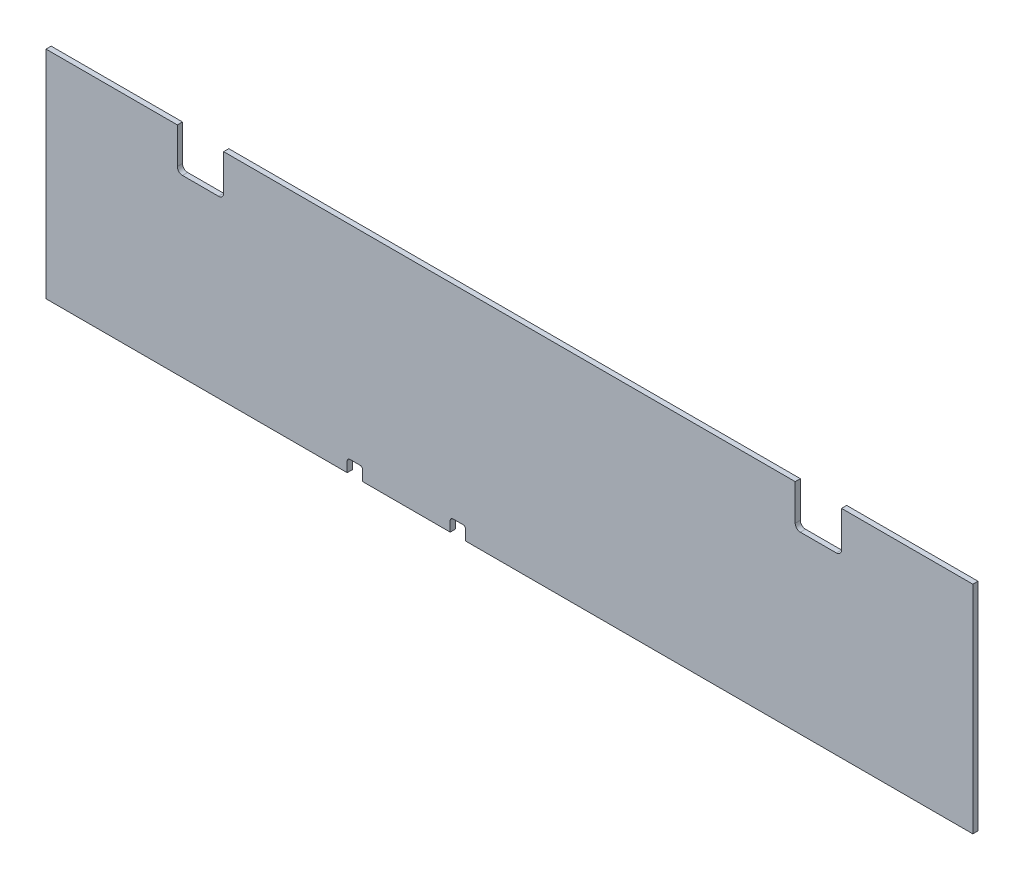
ISO-10303-21;
HEADER;
FILE_DESCRIPTION(('STEP AP214'),'2;1');
FILE_NAME('part.step','',(''),(''),'','','');
FILE_SCHEMA(('AUTOMOTIVE_DESIGN { 1 0 10303 214 1 1 1 1 }'));
ENDSEC;
DATA;
#1=APPLICATION_CONTEXT('core data for automotive mechanical design processes');
#2=APPLICATION_PROTOCOL_DEFINITION('international standard','automotive_design',2000,#1);
#3=PRODUCT_CONTEXT('',#1,'mechanical');
#4=PRODUCT('Part','Part','',(#3));
#5=PRODUCT_RELATED_PRODUCT_CATEGORY('part','',(#4));
#6=PRODUCT_DEFINITION_FORMATION('','',#4);
#7=PRODUCT_DEFINITION_CONTEXT('part definition',#1,'design');
#8=PRODUCT_DEFINITION('design','',#6,#7);
#9=PRODUCT_DEFINITION_SHAPE('','',#8);
#10=(LENGTH_UNIT() NAMED_UNIT(*) SI_UNIT(.MILLI.,.METRE.));
#11=(NAMED_UNIT(*) PLANE_ANGLE_UNIT() SI_UNIT($,.RADIAN.));
#12=(NAMED_UNIT(*) SI_UNIT($,.STERADIAN.) SOLID_ANGLE_UNIT());
#13=UNCERTAINTY_MEASURE_WITH_UNIT(LENGTH_MEASURE(1.E-05),#10,'distance_accuracy_value','');
#14=(GEOMETRIC_REPRESENTATION_CONTEXT(3) GLOBAL_UNCERTAINTY_ASSIGNED_CONTEXT((#13)) GLOBAL_UNIT_ASSIGNED_CONTEXT((#10,
#11,#12)) REPRESENTATION_CONTEXT('',''));
#15=CARTESIAN_POINT('',(0.,0.,0.));
#16=DIRECTION('',(0.,0.,1.));
#17=DIRECTION('',(1.,0.,0.));
#18=AXIS2_PLACEMENT_3D('',#15,#16,#17);
#19=CARTESIAN_POINT('',(1143.,0.,6.35));
#20=DIRECTION('',(0.,1.,0.));
#21=DIRECTION('',(-1.,0.,0.));
#22=AXIS2_PLACEMENT_3D('',#19,#20,#21);
#23=PLANE('',#22);
#24=DIRECTION('',(1.,0.,0.));
#25=VECTOR('',#24,1.);
#26=CARTESIAN_POINT('',(1143.,0.,0.));
#27=LINE('',#26,#25);
#28=CARTESIAN_POINT('',(0.,0.,0.));
#29=VERTEX_POINT('',#28);
#30=CARTESIAN_POINT('',(371.475,0.,0.));
#31=VERTEX_POINT('',#30);
#32=EDGE_CURVE('E222',#29,#31,#27,.T.);
#33=ORIENTED_EDGE('',*,*,#32,.T.);
#34=DIRECTION('',(0.,0.,1.));
#35=VECTOR('',#34,1.);
#36=CARTESIAN_POINT('',(371.475,0.,0.));
#37=LINE('',#36,#35);
#38=CARTESIAN_POINT('',(371.475,0.,6.35));
#39=VERTEX_POINT('',#38);
#40=EDGE_CURVE('E228',#31,#39,#37,.T.);
#41=ORIENTED_EDGE('',*,*,#40,.T.);
#42=DIRECTION('',(1.,0.,0.));
#43=VECTOR('',#42,1.);
#44=CARTESIAN_POINT('',(1143.,0.,6.35));
#45=LINE('',#44,#43);
#46=CARTESIAN_POINT('',(0.,0.,6.35));
#47=VERTEX_POINT('',#46);
#48=EDGE_CURVE('E283',#47,#39,#45,.T.);
#49=ORIENTED_EDGE('',*,*,#48,.F.);
#50=DIRECTION('',(0.,0.,-1.));
#51=VECTOR('',#50,1.);
#52=CARTESIAN_POINT('',(0.,0.,6.35));
#53=LINE('',#52,#51);
#54=EDGE_CURVE('E240',#47,#29,#53,.T.);
#55=ORIENTED_EDGE('',*,*,#54,.T.);
#56=EDGE_LOOP('',(#33,#41,#49,#55));
#57=FACE_BOUND('',#56,.T.);
#58=ADVANCED_FACE('F35',(#57),#23,.F.);
#59=CARTESIAN_POINT('',(390.525,0.,6.35));
#60=VERTEX_POINT('',#59);
#61=CARTESIAN_POINT('',(498.475,0.,6.35));
#62=VERTEX_POINT('',#61);
#63=EDGE_CURVE('E286',#60,#62,#45,.T.);
#64=ORIENTED_EDGE('',*,*,#63,.F.);
#65=DIRECTION('',(0.,0.,1.));
#66=VECTOR('',#65,1.);
#67=CARTESIAN_POINT('',(390.525,0.,0.));
#68=LINE('',#67,#66);
#69=CARTESIAN_POINT('',(390.525,0.,0.));
#70=VERTEX_POINT('',#69);
#71=EDGE_CURVE('E235',#70,#60,#68,.T.);
#72=ORIENTED_EDGE('',*,*,#71,.F.);
#73=CARTESIAN_POINT('',(498.475,0.,0.));
#74=VERTEX_POINT('',#73);
#75=EDGE_CURVE('E242',#70,#74,#27,.T.);
#76=ORIENTED_EDGE('',*,*,#75,.T.);
#77=DIRECTION('',(0.,0.,1.));
#78=VECTOR('',#77,1.);
#79=CARTESIAN_POINT('',(498.475,0.,0.));
#80=LINE('',#79,#78);
#81=EDGE_CURVE('E271',#74,#62,#80,.T.);
#82=ORIENTED_EDGE('',*,*,#81,.T.);
#83=EDGE_LOOP('',(#64,#72,#76,#82));
#84=FACE_BOUND('',#83,.T.);
#85=ADVANCED_FACE('F421',(#84),#23,.F.);
#86=CARTESIAN_POINT('',(517.525,0.,6.35));
#87=VERTEX_POINT('',#86);
#88=CARTESIAN_POINT('',(1143.,0.,6.35));
#89=VERTEX_POINT('',#88);
#90=EDGE_CURVE('E287',#87,#89,#45,.T.);
#91=ORIENTED_EDGE('',*,*,#90,.F.);
#92=DIRECTION('',(0.,0.,1.));
#93=VECTOR('',#92,1.);
#94=CARTESIAN_POINT('',(517.525,0.,0.));
#95=LINE('',#94,#93);
#96=CARTESIAN_POINT('',(517.525,0.,0.));
#97=VERTEX_POINT('',#96);
#98=EDGE_CURVE('E279',#97,#87,#95,.T.);
#99=ORIENTED_EDGE('',*,*,#98,.F.);
#100=CARTESIAN_POINT('',(1143.,0.,0.));
#101=VERTEX_POINT('',#100);
#102=EDGE_CURVE('E244',#97,#101,#27,.T.);
#103=ORIENTED_EDGE('',*,*,#102,.T.);
#104=DIRECTION('',(0.,0.,-1.));
#105=VECTOR('',#104,1.);
#106=CARTESIAN_POINT('',(1143.,0.,6.35));
#107=LINE('',#106,#105);
#108=EDGE_CURVE('E336',#89,#101,#107,.T.);
#109=ORIENTED_EDGE('',*,*,#108,.F.);
#110=EDGE_LOOP('',(#91,#99,#103,#109));
#111=FACE_BOUND('',#110,.T.);
#112=ADVANCED_FACE('F423',(#111),#23,.F.);
#113=CARTESIAN_POINT('',(1143.,266.7,6.35));
#114=DIRECTION('',(-1.,0.,0.));
#115=DIRECTION('',(0.,0.,1.));
#116=AXIS2_PLACEMENT_3D('',#113,#114,#115);
#117=PLANE('',#116);
#118=DIRECTION('',(0.,1.,0.));
#119=VECTOR('',#118,1.);
#120=CARTESIAN_POINT('',(1143.,266.7,0.));
#121=LINE('',#120,#119);
#122=CARTESIAN_POINT('',(1143.,266.7,0.));
#123=VERTEX_POINT('',#122);
#124=EDGE_CURVE('E241',#101,#123,#121,.T.);
#125=ORIENTED_EDGE('',*,*,#124,.T.);
#126=DIRECTION('',(0.,0.,-1.));
#127=VECTOR('',#126,1.);
#128=CARTESIAN_POINT('',(1143.,266.7,6.35));
#129=LINE('',#128,#127);
#130=CARTESIAN_POINT('',(1143.,266.7,6.35));
#131=VERTEX_POINT('',#130);
#132=EDGE_CURVE('E333',#131,#123,#129,.T.);
#133=ORIENTED_EDGE('',*,*,#132,.F.);
#134=DIRECTION('',(0.,1.,0.));
#135=VECTOR('',#134,1.);
#136=CARTESIAN_POINT('',(1143.,266.7,6.35));
#137=LINE('',#136,#135);
#138=EDGE_CURVE('E285',#89,#131,#137,.T.);
#139=ORIENTED_EDGE('',*,*,#138,.F.);
#140=ORIENTED_EDGE('',*,*,#108,.T.);
#141=EDGE_LOOP('',(#125,#133,#139,#140));
#142=FACE_BOUND('',#141,.T.);
#143=ADVANCED_FACE('F432',(#142),#117,.F.);
#144=CARTESIAN_POINT('',(981.075,266.7,6.35));
#145=DIRECTION('',(0.,-1.,0.));
#146=DIRECTION('',(0.,0.,-1.));
#147=AXIS2_PLACEMENT_3D('',#144,#145,#146);
#148=PLANE('',#147);
#149=DIRECTION('',(-1.,0.,0.));
#150=VECTOR('',#149,1.);
#151=CARTESIAN_POINT('',(981.075,266.7,0.));
#152=LINE('',#151,#150);
#153=CARTESIAN_POINT('',(981.075,266.7,0.));
#154=VERTEX_POINT('',#153);
#155=EDGE_CURVE('E245',#123,#154,#152,.T.);
#156=ORIENTED_EDGE('',*,*,#155,.T.);
#157=DIRECTION('',(0.,0.,-1.));
#158=VECTOR('',#157,1.);
#159=CARTESIAN_POINT('',(981.075,266.7,6.35));
#160=LINE('',#159,#158);
#161=CARTESIAN_POINT('',(981.075,266.7,6.35));
#162=VERTEX_POINT('',#161);
#163=EDGE_CURVE('E330',#162,#154,#160,.T.);
#164=ORIENTED_EDGE('',*,*,#163,.F.);
#165=DIRECTION('',(-1.,0.,0.));
#166=VECTOR('',#165,1.);
#167=CARTESIAN_POINT('',(981.075,266.7,6.35));
#168=LINE('',#167,#166);
#169=EDGE_CURVE('E289',#131,#162,#168,.T.);
#170=ORIENTED_EDGE('',*,*,#169,.F.);
#171=ORIENTED_EDGE('',*,*,#132,.T.);
#172=EDGE_LOOP('',(#156,#164,#170,#171));
#173=FACE_BOUND('',#172,.T.);
#174=ADVANCED_FACE('F437',(#173),#148,.F.);
#175=CARTESIAN_POINT('',(981.075,215.9,6.35));
#176=DIRECTION('',(1.,0.,0.));
#177=DIRECTION('',(0.,0.,-1.));
#178=AXIS2_PLACEMENT_3D('',#175,#176,#177);
#179=PLANE('',#178);
#180=DIRECTION('',(0.,-1.,0.));
#181=VECTOR('',#180,1.);
#182=CARTESIAN_POINT('',(981.075,215.9,0.));
#183=LINE('',#182,#181);
#184=CARTESIAN_POINT('',(981.075,222.25,0.));
#185=VERTEX_POINT('',#184);
#186=EDGE_CURVE('E464',#154,#185,#183,.T.);
#187=ORIENTED_EDGE('',*,*,#186,.T.);
#188=DIRECTION('',(0.,0.,-1.));
#189=VECTOR('',#188,1.);
#190=CARTESIAN_POINT('',(981.075,222.25,6.35));
#191=LINE('',#190,#189);
#192=CARTESIAN_POINT('',(981.075,222.25,6.35));
#193=VERTEX_POINT('',#192);
#194=EDGE_CURVE('E347',#185,#193,#191,.F.);
#195=ORIENTED_EDGE('',*,*,#194,.T.);
#196=DIRECTION('',(0.,-1.,0.));
#197=VECTOR('',#196,1.);
#198=CARTESIAN_POINT('',(981.075,215.9,6.35));
#199=LINE('',#198,#197);
#200=EDGE_CURVE('E291',#162,#193,#199,.T.);
#201=ORIENTED_EDGE('',*,*,#200,.F.);
#202=ORIENTED_EDGE('',*,*,#163,.T.);
#203=EDGE_LOOP('',(#187,#195,#201,#202));
#204=FACE_BOUND('',#203,.T.);
#205=ADVANCED_FACE('F475',(#204),#179,.F.);
#206=CARTESIAN_POINT('',(923.925,215.9,6.35));
#207=DIRECTION('',(0.,-1.,0.));
#208=DIRECTION('',(0.,0.,-1.));
#209=AXIS2_PLACEMENT_3D('',#206,#207,#208);
#210=PLANE('',#209);
#211=DIRECTION('',(-1.,0.,0.));
#212=VECTOR('',#211,1.);
#213=CARTESIAN_POINT('',(923.925,215.9,0.));
#214=LINE('',#213,#212);
#215=CARTESIAN_POINT('',(974.725,215.9,0.));
#216=VERTEX_POINT('',#215);
#217=CARTESIAN_POINT('',(930.275,215.9,0.));
#218=VERTEX_POINT('',#217);
#219=EDGE_CURVE('E461',#216,#218,#214,.T.);
#220=ORIENTED_EDGE('',*,*,#219,.T.);
#221=DIRECTION('',(0.,0.,-1.));
#222=VECTOR('',#221,1.);
#223=CARTESIAN_POINT('',(930.275,215.9,6.35));
#224=LINE('',#223,#222);
#225=CARTESIAN_POINT('',(930.275,215.9,6.35));
#226=VERTEX_POINT('',#225);
#227=EDGE_CURVE('E345',#218,#226,#224,.F.);
#228=ORIENTED_EDGE('',*,*,#227,.T.);
#229=DIRECTION('',(-1.,0.,0.));
#230=VECTOR('',#229,1.);
#231=CARTESIAN_POINT('',(923.925,215.9,6.35));
#232=LINE('',#231,#230);
#233=CARTESIAN_POINT('',(974.725,215.9,6.35));
#234=VERTEX_POINT('',#233);
#235=EDGE_CURVE('E294',#234,#226,#232,.T.);
#236=ORIENTED_EDGE('',*,*,#235,.F.);
#237=DIRECTION('',(0.,0.,-1.));
#238=VECTOR('',#237,1.);
#239=CARTESIAN_POINT('',(974.725,215.9,0.));
#240=LINE('',#239,#238);
#241=EDGE_CURVE('E342',#234,#216,#240,.T.);
#242=ORIENTED_EDGE('',*,*,#241,.T.);
#243=EDGE_LOOP('',(#220,#228,#236,#242));
#244=FACE_BOUND('',#243,.T.);
#245=ADVANCED_FACE('F484',(#244),#210,.F.);
#246=CARTESIAN_POINT('',(923.925,266.7,6.35));
#247=DIRECTION('',(-1.,0.,0.));
#248=DIRECTION('',(0.,0.,1.));
#249=AXIS2_PLACEMENT_3D('',#246,#247,#248);
#250=PLANE('',#249);
#251=DIRECTION('',(0.,1.,0.));
#252=VECTOR('',#251,1.);
#253=CARTESIAN_POINT('',(923.925,266.7,6.35));
#254=LINE('',#253,#252);
#255=CARTESIAN_POINT('',(923.925,222.25,6.35));
#256=VERTEX_POINT('',#255);
#257=CARTESIAN_POINT('',(923.925,266.7,6.35));
#258=VERTEX_POINT('',#257);
#259=EDGE_CURVE('E297',#256,#258,#254,.T.);
#260=ORIENTED_EDGE('',*,*,#259,.F.);
#261=DIRECTION('',(0.,0.,-1.));
#262=VECTOR('',#261,1.);
#263=CARTESIAN_POINT('',(923.925,222.25,0.));
#264=LINE('',#263,#262);
#265=CARTESIAN_POINT('',(923.925,222.25,0.));
#266=VERTEX_POINT('',#265);
#267=EDGE_CURVE('E339',#256,#266,#264,.T.);
#268=ORIENTED_EDGE('',*,*,#267,.T.);
#269=DIRECTION('',(0.,1.,0.));
#270=VECTOR('',#269,1.);
#271=CARTESIAN_POINT('',(923.925,266.7,0.));
#272=LINE('',#271,#270);
#273=CARTESIAN_POINT('',(923.925,266.7,0.));
#274=VERTEX_POINT('',#273);
#275=EDGE_CURVE('E459',#266,#274,#272,.T.);
#276=ORIENTED_EDGE('',*,*,#275,.T.);
#277=DIRECTION('',(0.,0.,-1.));
#278=VECTOR('',#277,1.);
#279=CARTESIAN_POINT('',(923.925,266.7,6.35));
#280=LINE('',#279,#278);
#281=EDGE_CURVE('E327',#258,#274,#280,.T.);
#282=ORIENTED_EDGE('',*,*,#281,.F.);
#283=EDGE_LOOP('',(#260,#268,#276,#282));
#284=FACE_BOUND('',#283,.T.);
#285=ADVANCED_FACE('F493',(#284),#250,.F.);
#286=CARTESIAN_POINT('',(219.075,266.7,6.35));
#287=DIRECTION('',(0.,-1.,0.));
#288=DIRECTION('',(0.,0.,-1.));
#289=AXIS2_PLACEMENT_3D('',#286,#287,#288);
#290=PLANE('',#289);
#291=DIRECTION('',(-1.,0.,0.));
#292=VECTOR('',#291,1.);
#293=CARTESIAN_POINT('',(219.075,266.7,0.));
#294=LINE('',#293,#292);
#295=CARTESIAN_POINT('',(219.075,266.7,0.));
#296=VERTEX_POINT('',#295);
#297=EDGE_CURVE('E457',#274,#296,#294,.T.);
#298=ORIENTED_EDGE('',*,*,#297,.T.);
#299=DIRECTION('',(0.,0.,-1.));
#300=VECTOR('',#299,1.);
#301=CARTESIAN_POINT('',(219.075,266.7,6.35));
#302=LINE('',#301,#300);
#303=CARTESIAN_POINT('',(219.075,266.7,6.35));
#304=VERTEX_POINT('',#303);
#305=EDGE_CURVE('E324',#304,#296,#302,.T.);
#306=ORIENTED_EDGE('',*,*,#305,.F.);
#307=DIRECTION('',(-1.,0.,0.));
#308=VECTOR('',#307,1.);
#309=CARTESIAN_POINT('',(219.075,266.7,6.35));
#310=LINE('',#309,#308);
#311=EDGE_CURVE('E299',#258,#304,#310,.T.);
#312=ORIENTED_EDGE('',*,*,#311,.F.);
#313=ORIENTED_EDGE('',*,*,#281,.T.);
#314=EDGE_LOOP('',(#298,#306,#312,#313));
#315=FACE_BOUND('',#314,.T.);
#316=ADVANCED_FACE('F499',(#315),#290,.F.);
#317=CARTESIAN_POINT('',(219.075,215.9,6.35));
#318=DIRECTION('',(1.,0.,0.));
#319=DIRECTION('',(0.,0.,-1.));
#320=AXIS2_PLACEMENT_3D('',#317,#318,#319);
#321=PLANE('',#320);
#322=DIRECTION('',(0.,-1.,0.));
#323=VECTOR('',#322,1.);
#324=CARTESIAN_POINT('',(219.075,215.9,0.));
#325=LINE('',#324,#323);
#326=CARTESIAN_POINT('',(219.075,222.25,0.));
#327=VERTEX_POINT('',#326);
#328=EDGE_CURVE('E454',#296,#327,#325,.T.);
#329=ORIENTED_EDGE('',*,*,#328,.T.);
#330=DIRECTION('',(0.,0.,-1.));
#331=VECTOR('',#330,1.);
#332=CARTESIAN_POINT('',(219.075,222.25,6.35));
#333=LINE('',#332,#331);
#334=CARTESIAN_POINT('',(219.075,222.25,6.35));
#335=VERTEX_POINT('',#334);
#336=EDGE_CURVE('E354',#327,#335,#333,.F.);
#337=ORIENTED_EDGE('',*,*,#336,.T.);
#338=DIRECTION('',(0.,-1.,0.));
#339=VECTOR('',#338,1.);
#340=CARTESIAN_POINT('',(219.075,215.9,6.35));
#341=LINE('',#340,#339);
#342=EDGE_CURVE('E301',#304,#335,#341,.T.);
#343=ORIENTED_EDGE('',*,*,#342,.F.);
#344=ORIENTED_EDGE('',*,*,#305,.T.);
#345=EDGE_LOOP('',(#329,#337,#343,#344));
#346=FACE_BOUND('',#345,.T.);
#347=ADVANCED_FACE('F503',(#346),#321,.F.);
#348=CARTESIAN_POINT('',(161.925,215.9,6.35));
#349=DIRECTION('',(0.,-1.,0.));
#350=DIRECTION('',(0.,0.,-1.));
#351=AXIS2_PLACEMENT_3D('',#348,#349,#350);
#352=PLANE('',#351);
#353=DIRECTION('',(-1.,0.,0.));
#354=VECTOR('',#353,1.);
#355=CARTESIAN_POINT('',(161.925,215.9,6.35));
#356=LINE('',#355,#354);
#357=CARTESIAN_POINT('',(212.725,215.9,6.35));
#358=VERTEX_POINT('',#357);
#359=CARTESIAN_POINT('',(168.275,215.9,6.35));
#360=VERTEX_POINT('',#359);
#361=EDGE_CURVE('E304',#358,#360,#356,.T.);
#362=ORIENTED_EDGE('',*,*,#361,.F.);
#363=DIRECTION('',(0.,0.,-1.));
#364=VECTOR('',#363,1.);
#365=CARTESIAN_POINT('',(212.725,215.9,0.));
#366=LINE('',#365,#364);
#367=CARTESIAN_POINT('',(212.725,215.9,0.));
#368=VERTEX_POINT('',#367);
#369=EDGE_CURVE('E351',#358,#368,#366,.T.);
#370=ORIENTED_EDGE('',*,*,#369,.T.);
#371=DIRECTION('',(-1.,0.,0.));
#372=VECTOR('',#371,1.);
#373=CARTESIAN_POINT('',(161.925,215.9,0.));
#374=LINE('',#373,#372);
#375=CARTESIAN_POINT('',(168.275,215.9,0.));
#376=VERTEX_POINT('',#375);
#377=EDGE_CURVE('E449',#368,#376,#374,.T.);
#378=ORIENTED_EDGE('',*,*,#377,.T.);
#379=DIRECTION('',(0.,0.,-1.));
#380=VECTOR('',#379,1.);
#381=CARTESIAN_POINT('',(168.275,215.9,6.35));
#382=LINE('',#381,#380);
#383=EDGE_CURVE('E349',#376,#360,#382,.F.);
#384=ORIENTED_EDGE('',*,*,#383,.T.);
#385=EDGE_LOOP('',(#362,#370,#378,#384));
#386=FACE_BOUND('',#385,.T.);
#387=ADVANCED_FACE('F512',(#386),#352,.F.);
#388=CARTESIAN_POINT('',(161.925,266.7,6.35));
#389=DIRECTION('',(-1.,0.,0.));
#390=DIRECTION('',(0.,0.,1.));
#391=AXIS2_PLACEMENT_3D('',#388,#389,#390);
#392=PLANE('',#391);
#393=DIRECTION('',(0.,1.,0.));
#394=VECTOR('',#393,1.);
#395=CARTESIAN_POINT('',(161.925,266.7,6.35));
#396=LINE('',#395,#394);
#397=CARTESIAN_POINT('',(161.925,222.25,6.35));
#398=VERTEX_POINT('',#397);
#399=CARTESIAN_POINT('',(161.925,266.7,6.35));
#400=VERTEX_POINT('',#399);
#401=EDGE_CURVE('E307',#398,#400,#396,.T.);
#402=ORIENTED_EDGE('',*,*,#401,.F.);
#403=DIRECTION('',(0.,0.,-1.));
#404=VECTOR('',#403,1.);
#405=CARTESIAN_POINT('',(161.925,222.25,0.));
#406=LINE('',#405,#404);
#407=CARTESIAN_POINT('',(161.925,222.25,0.));
#408=VERTEX_POINT('',#407);
#409=EDGE_CURVE('E356',#398,#408,#406,.T.);
#410=ORIENTED_EDGE('',*,*,#409,.T.);
#411=DIRECTION('',(0.,1.,0.));
#412=VECTOR('',#411,1.);
#413=CARTESIAN_POINT('',(161.925,266.7,0.));
#414=LINE('',#413,#412);
#415=CARTESIAN_POINT('',(161.925,266.7,0.));
#416=VERTEX_POINT('',#415);
#417=EDGE_CURVE('E445',#408,#416,#414,.T.);
#418=ORIENTED_EDGE('',*,*,#417,.T.);
#419=DIRECTION('',(0.,0.,-1.));
#420=VECTOR('',#419,1.);
#421=CARTESIAN_POINT('',(161.925,266.7,6.35));
#422=LINE('',#421,#420);
#423=EDGE_CURVE('E316',#400,#416,#422,.T.);
#424=ORIENTED_EDGE('',*,*,#423,.F.);
#425=EDGE_LOOP('',(#402,#410,#418,#424));
#426=FACE_BOUND('',#425,.T.);
#427=ADVANCED_FACE('F521',(#426),#392,.F.);
#428=CARTESIAN_POINT('',(0.,266.7,6.35));
#429=DIRECTION('',(0.,-1.,0.));
#430=DIRECTION('',(0.,0.,-1.));
#431=AXIS2_PLACEMENT_3D('',#428,#429,#430);
#432=PLANE('',#431);
#433=DIRECTION('',(-1.,0.,0.));
#434=VECTOR('',#433,1.);
#435=CARTESIAN_POINT('',(0.,266.7,0.));
#436=LINE('',#435,#434);
#437=CARTESIAN_POINT('',(0.,266.7,0.));
#438=VERTEX_POINT('',#437);
#439=EDGE_CURVE('E443',#416,#438,#436,.T.);
#440=ORIENTED_EDGE('',*,*,#439,.T.);
#441=DIRECTION('',(0.,0.,-1.));
#442=VECTOR('',#441,1.);
#443=CARTESIAN_POINT('',(0.,266.7,6.35));
#444=LINE('',#443,#442);
#445=CARTESIAN_POINT('',(0.,266.7,6.35));
#446=VERTEX_POINT('',#445);
#447=EDGE_CURVE('E313',#446,#438,#444,.T.);
#448=ORIENTED_EDGE('',*,*,#447,.F.);
#449=DIRECTION('',(-1.,0.,0.));
#450=VECTOR('',#449,1.);
#451=CARTESIAN_POINT('',(0.,266.7,6.35));
#452=LINE('',#451,#450);
#453=EDGE_CURVE('E309',#400,#446,#452,.T.);
#454=ORIENTED_EDGE('',*,*,#453,.F.);
#455=ORIENTED_EDGE('',*,*,#423,.T.);
#456=EDGE_LOOP('',(#440,#448,#454,#455));
#457=FACE_BOUND('',#456,.T.);
#458=ADVANCED_FACE('F524',(#457),#432,.F.);
#459=CARTESIAN_POINT('',(0.,0.,6.35));
#460=DIRECTION('',(1.,0.,0.));
#461=DIRECTION('',(0.,0.,-1.));
#462=AXIS2_PLACEMENT_3D('',#459,#460,#461);
#463=PLANE('',#462);
#464=DIRECTION('',(0.,-1.,0.));
#465=VECTOR('',#464,1.);
#466=CARTESIAN_POINT('',(0.,0.,0.));
#467=LINE('',#466,#465);
#468=EDGE_CURVE('E319',#438,#29,#467,.T.);
#469=ORIENTED_EDGE('',*,*,#468,.T.);
#470=ORIENTED_EDGE('',*,*,#54,.F.);
#471=DIRECTION('',(0.,-1.,0.));
#472=VECTOR('',#471,1.);
#473=CARTESIAN_POINT('',(0.,0.,6.35));
#474=LINE('',#473,#472);
#475=EDGE_CURVE('E310',#446,#47,#474,.T.);
#476=ORIENTED_EDGE('',*,*,#475,.F.);
#477=ORIENTED_EDGE('',*,*,#447,.T.);
#478=EDGE_LOOP('',(#469,#470,#476,#477));
#479=FACE_BOUND('',#478,.T.);
#480=ADVANCED_FACE('F525',(#479),#463,.F.);
#481=CARTESIAN_POINT('',(0.,0.,6.35));
#482=DIRECTION('',(0.,0.,-1.));
#483=DIRECTION('',(-1.,0.,0.));
#484=AXIS2_PLACEMENT_3D('',#481,#482,#483);
#485=PLANE('',#484);
#486=ORIENTED_EDGE('',*,*,#48,.T.);
#487=DIRECTION('',(0.,-1.,0.));
#488=VECTOR('',#487,1.);
#489=CARTESIAN_POINT('',(371.475,0.,6.35));
#490=LINE('',#489,#488);
#491=CARTESIAN_POINT('',(371.475,12.7,6.35));
#492=VERTEX_POINT('',#491);
#493=EDGE_CURVE('E231',#492,#39,#490,.T.);
#494=ORIENTED_EDGE('',*,*,#493,.F.);
#495=CARTESIAN_POINT('',(374.65,12.7,6.35));
#496=DIRECTION('',(0.,0.,-1.));
#497=DIRECTION('',(-1.,0.,0.));
#498=AXIS2_PLACEMENT_3D('',#495,#496,#497);
#499=CIRCLE('',#498,3.175);
#500=CARTESIAN_POINT('',(374.65,15.875,6.35));
#501=VERTEX_POINT('',#500);
#502=EDGE_CURVE('E43',#492,#501,#499,.T.);
#503=ORIENTED_EDGE('',*,*,#502,.T.);
#504=DIRECTION('',(-1.,0.,0.));
#505=VECTOR('',#504,1.);
#506=CARTESIAN_POINT('',(371.475,15.875,6.35));
#507=LINE('',#506,#505);
#508=CARTESIAN_POINT('',(387.35,15.875,6.35));
#509=VERTEX_POINT('',#508);
#510=EDGE_CURVE('E225',#509,#501,#507,.T.);
#511=ORIENTED_EDGE('',*,*,#510,.F.);
#512=CARTESIAN_POINT('',(387.35,12.7,6.35));
#513=DIRECTION('',(0.,0.,-1.));
#514=DIRECTION('',(-1.,0.,0.));
#515=AXIS2_PLACEMENT_3D('',#512,#513,#514);
#516=CIRCLE('',#515,3.175);
#517=CARTESIAN_POINT('',(390.525,12.7,6.35));
#518=VERTEX_POINT('',#517);
#519=EDGE_CURVE('E402',#509,#518,#516,.T.);
#520=ORIENTED_EDGE('',*,*,#519,.T.);
#521=DIRECTION('',(0.,1.,0.));
#522=VECTOR('',#521,1.);
#523=CARTESIAN_POINT('',(390.525,0.,6.35));
#524=LINE('',#523,#522);
#525=EDGE_CURVE('E412',#60,#518,#524,.T.);
#526=ORIENTED_EDGE('',*,*,#525,.F.);
#527=ORIENTED_EDGE('',*,*,#63,.T.);
#528=DIRECTION('',(0.,-1.,0.));
#529=VECTOR('',#528,1.);
#530=CARTESIAN_POINT('',(498.475,0.,6.35));
#531=LINE('',#530,#529);
#532=CARTESIAN_POINT('',(498.475,12.7,6.35));
#533=VERTEX_POINT('',#532);
#534=EDGE_CURVE('E272',#533,#62,#531,.T.);
#535=ORIENTED_EDGE('',*,*,#534,.F.);
#536=CARTESIAN_POINT('',(501.65,12.7,6.35));
#537=DIRECTION('',(0.,0.,-1.));
#538=DIRECTION('',(-1.,0.,0.));
#539=AXIS2_PLACEMENT_3D('',#536,#537,#538);
#540=CIRCLE('',#539,3.175);
#541=CARTESIAN_POINT('',(501.65,15.875,6.35));
#542=VERTEX_POINT('',#541);
#543=EDGE_CURVE('E394',#533,#542,#540,.T.);
#544=ORIENTED_EDGE('',*,*,#543,.T.);
#545=DIRECTION('',(-1.,0.,0.));
#546=VECTOR('',#545,1.);
#547=CARTESIAN_POINT('',(498.475,15.875,6.35));
#548=LINE('',#547,#546);
#549=CARTESIAN_POINT('',(514.35,15.875,6.35));
#550=VERTEX_POINT('',#549);
#551=EDGE_CURVE('E265',#550,#542,#548,.T.);
#552=ORIENTED_EDGE('',*,*,#551,.F.);
#553=CARTESIAN_POINT('',(514.35,12.7,6.35));
#554=DIRECTION('',(0.,0.,-1.));
#555=DIRECTION('',(-1.,0.,0.));
#556=AXIS2_PLACEMENT_3D('',#553,#554,#555);
#557=CIRCLE('',#556,3.175);
#558=CARTESIAN_POINT('',(517.525,12.7,6.35));
#559=VERTEX_POINT('',#558);
#560=EDGE_CURVE('E398',#550,#559,#557,.T.);
#561=ORIENTED_EDGE('',*,*,#560,.T.);
#562=DIRECTION('',(0.,1.,0.));
#563=VECTOR('',#562,1.);
#564=CARTESIAN_POINT('',(517.525,0.,6.35));
#565=LINE('',#564,#563);
#566=EDGE_CURVE('E274',#87,#559,#565,.T.);
#567=ORIENTED_EDGE('',*,*,#566,.F.);
#568=ORIENTED_EDGE('',*,*,#90,.T.);
#569=ORIENTED_EDGE('',*,*,#138,.T.);
#570=ORIENTED_EDGE('',*,*,#169,.T.);
#571=ORIENTED_EDGE('',*,*,#200,.T.);
#572=CARTESIAN_POINT('',(974.725,222.25,6.35));
#573=DIRECTION('',(0.,0.,-1.));
#574=DIRECTION('',(-1.,0.,0.));
#575=AXIS2_PLACEMENT_3D('',#572,#573,#574);
#576=CIRCLE('',#575,6.35);
#577=EDGE_CURVE('E365',#193,#234,#576,.T.);
#578=ORIENTED_EDGE('',*,*,#577,.T.);
#579=ORIENTED_EDGE('',*,*,#235,.T.);
#580=CARTESIAN_POINT('',(930.275,222.25,6.35));
#581=DIRECTION('',(0.,0.,-1.));
#582=DIRECTION('',(-1.,0.,0.));
#583=AXIS2_PLACEMENT_3D('',#580,#581,#582);
#584=CIRCLE('',#583,6.35);
#585=EDGE_CURVE('E361',#226,#256,#584,.T.);
#586=ORIENTED_EDGE('',*,*,#585,.T.);
#587=ORIENTED_EDGE('',*,*,#259,.T.);
#588=ORIENTED_EDGE('',*,*,#311,.T.);
#589=ORIENTED_EDGE('',*,*,#342,.T.);
#590=CARTESIAN_POINT('',(212.725,222.25,6.35));
#591=DIRECTION('',(0.,0.,-1.));
#592=DIRECTION('',(-1.,0.,0.));
#593=AXIS2_PLACEMENT_3D('',#590,#591,#592);
#594=CIRCLE('',#593,6.35);
#595=EDGE_CURVE('E369',#335,#358,#594,.T.);
#596=ORIENTED_EDGE('',*,*,#595,.T.);
#597=ORIENTED_EDGE('',*,*,#361,.T.);
#598=CARTESIAN_POINT('',(168.275,222.25,6.35));
#599=DIRECTION('',(0.,0.,-1.));
#600=DIRECTION('',(-1.,0.,0.));
#601=AXIS2_PLACEMENT_3D('',#598,#599,#600);
#602=CIRCLE('',#601,6.35);
#603=EDGE_CURVE('E373',#360,#398,#602,.T.);
#604=ORIENTED_EDGE('',*,*,#603,.T.);
#605=ORIENTED_EDGE('',*,*,#401,.T.);
#606=ORIENTED_EDGE('',*,*,#453,.T.);
#607=ORIENTED_EDGE('',*,*,#475,.T.);
#608=EDGE_LOOP('',(#486,#494,#503,#511,#520,#526,#527,#535,#544,#552,#561,#567,#568,#569,#570,
#571,#578,#579,#586,#587,#588,#589,#596,#597,#604,#605,#606,#607));
#609=FACE_BOUND('',#608,.T.);
#610=ADVANCED_FACE('F407',(#609),#485,.F.);
#611=CARTESIAN_POINT('',(0.,0.,0.));
#612=DIRECTION('',(0.,0.,-1.));
#613=DIRECTION('',(-1.,0.,0.));
#614=AXIS2_PLACEMENT_3D('',#611,#612,#613);
#615=PLANE('',#614);
#616=DIRECTION('',(-1.,0.,0.));
#617=VECTOR('',#616,1.);
#618=CARTESIAN_POINT('',(371.475,15.875,0.));
#619=LINE('',#618,#617);
#620=CARTESIAN_POINT('',(387.35,15.875,0.));
#621=VERTEX_POINT('',#620);
#622=CARTESIAN_POINT('',(374.65,15.875,0.));
#623=VERTEX_POINT('',#622);
#624=EDGE_CURVE('E236',#621,#623,#619,.T.);
#625=ORIENTED_EDGE('',*,*,#624,.T.);
#626=CARTESIAN_POINT('',(374.65,12.7,0.));
#627=DIRECTION('',(0.,0.,-1.));
#628=DIRECTION('',(-1.,0.,0.));
#629=AXIS2_PLACEMENT_3D('',#626,#627,#628);
#630=CIRCLE('',#629,3.175);
#631=CARTESIAN_POINT('',(371.475,12.7,0.));
#632=VERTEX_POINT('',#631);
#633=EDGE_CURVE('E11',#623,#632,#630,.F.);
#634=ORIENTED_EDGE('',*,*,#633,.T.);
#635=DIRECTION('',(0.,-1.,0.));
#636=VECTOR('',#635,1.);
#637=CARTESIAN_POINT('',(371.475,0.,0.));
#638=LINE('',#637,#636);
#639=EDGE_CURVE('E217',#632,#31,#638,.T.);
#640=ORIENTED_EDGE('',*,*,#639,.T.);
#641=ORIENTED_EDGE('',*,*,#32,.F.);
#642=ORIENTED_EDGE('',*,*,#468,.F.);
#643=ORIENTED_EDGE('',*,*,#439,.F.);
#644=ORIENTED_EDGE('',*,*,#417,.F.);
#645=CARTESIAN_POINT('',(168.275,222.25,0.));
#646=DIRECTION('',(0.,0.,-1.));
#647=DIRECTION('',(-1.,0.,0.));
#648=AXIS2_PLACEMENT_3D('',#645,#646,#647);
#649=CIRCLE('',#648,6.35);
#650=EDGE_CURVE('E371',#408,#376,#649,.F.);
#651=ORIENTED_EDGE('',*,*,#650,.T.);
#652=ORIENTED_EDGE('',*,*,#377,.F.);
#653=CARTESIAN_POINT('',(212.725,222.25,0.));
#654=DIRECTION('',(0.,0.,-1.));
#655=DIRECTION('',(-1.,0.,0.));
#656=AXIS2_PLACEMENT_3D('',#653,#654,#655);
#657=CIRCLE('',#656,6.35);
#658=EDGE_CURVE('E367',#368,#327,#657,.F.);
#659=ORIENTED_EDGE('',*,*,#658,.T.);
#660=ORIENTED_EDGE('',*,*,#328,.F.);
#661=ORIENTED_EDGE('',*,*,#297,.F.);
#662=ORIENTED_EDGE('',*,*,#275,.F.);
#663=CARTESIAN_POINT('',(930.275,222.25,0.));
#664=DIRECTION('',(0.,0.,-1.));
#665=DIRECTION('',(-1.,0.,0.));
#666=AXIS2_PLACEMENT_3D('',#663,#664,#665);
#667=CIRCLE('',#666,6.35);
#668=EDGE_CURVE('E359',#266,#218,#667,.F.);
#669=ORIENTED_EDGE('',*,*,#668,.T.);
#670=ORIENTED_EDGE('',*,*,#219,.F.);
#671=CARTESIAN_POINT('',(974.725,222.25,0.));
#672=DIRECTION('',(0.,0.,-1.));
#673=DIRECTION('',(-1.,0.,0.));
#674=AXIS2_PLACEMENT_3D('',#671,#672,#673);
#675=CIRCLE('',#674,6.35);
#676=EDGE_CURVE('E363',#216,#185,#675,.F.);
#677=ORIENTED_EDGE('',*,*,#676,.T.);
#678=ORIENTED_EDGE('',*,*,#186,.F.);
#679=ORIENTED_EDGE('',*,*,#155,.F.);
#680=ORIENTED_EDGE('',*,*,#124,.F.);
#681=ORIENTED_EDGE('',*,*,#102,.F.);
#682=DIRECTION('',(0.,1.,0.));
#683=VECTOR('',#682,1.);
#684=CARTESIAN_POINT('',(517.525,0.,0.));
#685=LINE('',#684,#683);
#686=CARTESIAN_POINT('',(517.525,12.7,0.));
#687=VERTEX_POINT('',#686);
#688=EDGE_CURVE('E264',#97,#687,#685,.T.);
#689=ORIENTED_EDGE('',*,*,#688,.T.);
#690=CARTESIAN_POINT('',(514.35,12.7,0.));
#691=DIRECTION('',(0.,0.,-1.));
#692=DIRECTION('',(-1.,0.,0.));
#693=AXIS2_PLACEMENT_3D('',#690,#691,#692);
#694=CIRCLE('',#693,3.175);
#695=CARTESIAN_POINT('',(514.35,15.875,0.));
#696=VERTEX_POINT('',#695);
#697=EDGE_CURVE('E400',#687,#696,#694,.F.);
#698=ORIENTED_EDGE('',*,*,#697,.T.);
#699=DIRECTION('',(-1.,0.,0.));
#700=VECTOR('',#699,1.);
#701=CARTESIAN_POINT('',(498.475,15.875,0.));
#702=LINE('',#701,#700);
#703=CARTESIAN_POINT('',(501.65,15.875,0.));
#704=VERTEX_POINT('',#703);
#705=EDGE_CURVE('E268',#696,#704,#702,.T.);
#706=ORIENTED_EDGE('',*,*,#705,.T.);
#707=CARTESIAN_POINT('',(501.65,12.7,0.));
#708=DIRECTION('',(0.,0.,-1.));
#709=DIRECTION('',(-1.,0.,0.));
#710=AXIS2_PLACEMENT_3D('',#707,#708,#709);
#711=CIRCLE('',#710,3.175);
#712=CARTESIAN_POINT('',(498.475,12.7,0.));
#713=VERTEX_POINT('',#712);
#714=EDGE_CURVE('E396',#704,#713,#711,.F.);
#715=ORIENTED_EDGE('',*,*,#714,.T.);
#716=DIRECTION('',(0.,-1.,0.));
#717=VECTOR('',#716,1.);
#718=CARTESIAN_POINT('',(498.475,0.,0.));
#719=LINE('',#718,#717);
#720=EDGE_CURVE('E262',#713,#74,#719,.T.);
#721=ORIENTED_EDGE('',*,*,#720,.T.);
#722=ORIENTED_EDGE('',*,*,#75,.F.);
#723=DIRECTION('',(0.,1.,0.));
#724=VECTOR('',#723,1.);
#725=CARTESIAN_POINT('',(390.525,0.,0.));
#726=LINE('',#725,#724);
#727=CARTESIAN_POINT('',(390.525,12.7,0.));
#728=VERTEX_POINT('',#727);
#729=EDGE_CURVE('E224',#70,#728,#726,.T.);
#730=ORIENTED_EDGE('',*,*,#729,.T.);
#731=CARTESIAN_POINT('',(387.35,12.7,0.));
#732=DIRECTION('',(0.,0.,-1.));
#733=DIRECTION('',(-1.,0.,0.));
#734=AXIS2_PLACEMENT_3D('',#731,#732,#733);
#735=CIRCLE('',#734,3.175);
#736=EDGE_CURVE('E404',#728,#621,#735,.F.);
#737=ORIENTED_EDGE('',*,*,#736,.T.);
#738=EDGE_LOOP('',(#625,#634,#640,#641,#642,#643,#644,#651,#652,#659,#660,#661,#662,#669,#670,
#677,#678,#679,#680,#681,#689,#698,#706,#715,#721,#722,#730,#737));
#739=FACE_BOUND('',#738,.T.);
#740=ADVANCED_FACE('F219',(#739),#615,.T.);
#741=CARTESIAN_POINT('',(930.275,222.25,6.35));
#742=DIRECTION('',(0.,0.,1.));
#743=DIRECTION('',(1.,0.,0.));
#744=AXIS2_PLACEMENT_3D('',#741,#742,#743);
#745=CYLINDRICAL_SURFACE('',#744,6.35);
#746=ORIENTED_EDGE('',*,*,#585,.F.);
#747=ORIENTED_EDGE('',*,*,#227,.F.);
#748=ORIENTED_EDGE('',*,*,#668,.F.);
#749=ORIENTED_EDGE('',*,*,#267,.F.);
#750=EDGE_LOOP('',(#746,#747,#748,#749));
#751=FACE_BOUND('',#750,.T.);
#752=ADVANCED_FACE('F490',(#751),#745,.F.);
#753=CARTESIAN_POINT('',(974.725,222.25,6.35));
#754=DIRECTION('',(0.,0.,1.));
#755=DIRECTION('',(1.,0.,0.));
#756=AXIS2_PLACEMENT_3D('',#753,#754,#755);
#757=CYLINDRICAL_SURFACE('',#756,6.35);
#758=ORIENTED_EDGE('',*,*,#577,.F.);
#759=ORIENTED_EDGE('',*,*,#194,.F.);
#760=ORIENTED_EDGE('',*,*,#676,.F.);
#761=ORIENTED_EDGE('',*,*,#241,.F.);
#762=EDGE_LOOP('',(#758,#759,#760,#761));
#763=FACE_BOUND('',#762,.T.);
#764=ADVANCED_FACE('F481',(#763),#757,.F.);
#765=CARTESIAN_POINT('',(212.725,222.25,6.35));
#766=DIRECTION('',(0.,0.,1.));
#767=DIRECTION('',(1.,0.,0.));
#768=AXIS2_PLACEMENT_3D('',#765,#766,#767);
#769=CYLINDRICAL_SURFACE('',#768,6.35);
#770=ORIENTED_EDGE('',*,*,#595,.F.);
#771=ORIENTED_EDGE('',*,*,#336,.F.);
#772=ORIENTED_EDGE('',*,*,#658,.F.);
#773=ORIENTED_EDGE('',*,*,#369,.F.);
#774=EDGE_LOOP('',(#770,#771,#772,#773));
#775=FACE_BOUND('',#774,.T.);
#776=ADVANCED_FACE('F509',(#775),#769,.F.);
#777=CARTESIAN_POINT('',(168.275,222.25,6.35));
#778=DIRECTION('',(0.,0.,1.));
#779=DIRECTION('',(1.,0.,0.));
#780=AXIS2_PLACEMENT_3D('',#777,#778,#779);
#781=CYLINDRICAL_SURFACE('',#780,6.35);
#782=ORIENTED_EDGE('',*,*,#603,.F.);
#783=ORIENTED_EDGE('',*,*,#383,.F.);
#784=ORIENTED_EDGE('',*,*,#650,.F.);
#785=ORIENTED_EDGE('',*,*,#409,.F.);
#786=EDGE_LOOP('',(#782,#783,#784,#785));
#787=FACE_BOUND('',#786,.T.);
#788=ADVANCED_FACE('F518',(#787),#781,.F.);
#789=CARTESIAN_POINT('',(498.475,0.,0.));
#790=DIRECTION('',(-1.,0.,0.));
#791=DIRECTION('',(0.,0.,1.));
#792=AXIS2_PLACEMENT_3D('',#789,#790,#791);
#793=PLANE('',#792);
#794=ORIENTED_EDGE('',*,*,#720,.F.);
#795=DIRECTION('',(0.,0.,1.));
#796=VECTOR('',#795,1.);
#797=CARTESIAN_POINT('',(498.475,12.7,6.35));
#798=LINE('',#797,#796);
#799=EDGE_CURVE('E375',#713,#533,#798,.T.);
#800=ORIENTED_EDGE('',*,*,#799,.T.);
#801=ORIENTED_EDGE('',*,*,#534,.T.);
#802=ORIENTED_EDGE('',*,*,#81,.F.);
#803=EDGE_LOOP('',(#794,#800,#801,#802));
#804=FACE_BOUND('',#803,.T.);
#805=ADVANCED_FACE('F642',(#804),#793,.F.);
#806=CARTESIAN_POINT('',(498.475,15.875,0.));
#807=DIRECTION('',(0.,1.,0.));
#808=DIRECTION('',(-1.,0.,0.));
#809=AXIS2_PLACEMENT_3D('',#806,#807,#808);
#810=PLANE('',#809);
#811=ORIENTED_EDGE('',*,*,#551,.T.);
#812=DIRECTION('',(0.,0.,1.));
#813=VECTOR('',#812,1.);
#814=CARTESIAN_POINT('',(501.65,15.875,0.));
#815=LINE('',#814,#813);
#816=EDGE_CURVE('E381',#542,#704,#815,.F.);
#817=ORIENTED_EDGE('',*,*,#816,.T.);
#818=ORIENTED_EDGE('',*,*,#705,.F.);
#819=DIRECTION('',(0.,0.,1.));
#820=VECTOR('',#819,1.);
#821=CARTESIAN_POINT('',(514.35,15.875,6.35));
#822=LINE('',#821,#820);
#823=EDGE_CURVE('E378',#696,#550,#822,.T.);
#824=ORIENTED_EDGE('',*,*,#823,.T.);
#825=EDGE_LOOP('',(#811,#817,#818,#824));
#826=FACE_BOUND('',#825,.T.);
#827=ADVANCED_FACE('F660',(#826),#810,.F.);
#828=CARTESIAN_POINT('',(517.525,0.,0.));
#829=DIRECTION('',(1.,0.,0.));
#830=DIRECTION('',(0.,0.,-1.));
#831=AXIS2_PLACEMENT_3D('',#828,#829,#830);
#832=PLANE('',#831);
#833=ORIENTED_EDGE('',*,*,#566,.T.);
#834=DIRECTION('',(0.,0.,1.));
#835=VECTOR('',#834,1.);
#836=CARTESIAN_POINT('',(517.525,12.7,0.));
#837=LINE('',#836,#835);
#838=EDGE_CURVE('E383',#559,#687,#837,.F.);
#839=ORIENTED_EDGE('',*,*,#838,.T.);
#840=ORIENTED_EDGE('',*,*,#688,.F.);
#841=ORIENTED_EDGE('',*,*,#98,.T.);
#842=EDGE_LOOP('',(#833,#839,#840,#841));
#843=FACE_BOUND('',#842,.T.);
#844=ADVANCED_FACE('F669',(#843),#832,.F.);
#845=CARTESIAN_POINT('',(371.475,0.,0.));
#846=DIRECTION('',(-1.,0.,0.));
#847=DIRECTION('',(0.,0.,1.));
#848=AXIS2_PLACEMENT_3D('',#845,#846,#847);
#849=PLANE('',#848);
#850=ORIENTED_EDGE('',*,*,#639,.F.);
#851=DIRECTION('',(0.,0.,1.));
#852=VECTOR('',#851,1.);
#853=CARTESIAN_POINT('',(371.475,12.7,6.35));
#854=LINE('',#853,#852);
#855=EDGE_CURVE('E392',#632,#492,#854,.T.);
#856=ORIENTED_EDGE('',*,*,#855,.T.);
#857=ORIENTED_EDGE('',*,*,#493,.T.);
#858=ORIENTED_EDGE('',*,*,#40,.F.);
#859=EDGE_LOOP('',(#850,#856,#857,#858));
#860=FACE_BOUND('',#859,.T.);
#861=ADVANCED_FACE('F229',(#860),#849,.F.);
#862=CARTESIAN_POINT('',(371.475,15.875,0.));
#863=DIRECTION('',(0.,1.,0.));
#864=DIRECTION('',(-1.,0.,0.));
#865=AXIS2_PLACEMENT_3D('',#862,#863,#864);
#866=PLANE('',#865);
#867=ORIENTED_EDGE('',*,*,#624,.F.);
#868=DIRECTION('',(0.,0.,1.));
#869=VECTOR('',#868,1.);
#870=CARTESIAN_POINT('',(387.35,15.875,6.35));
#871=LINE('',#870,#869);
#872=EDGE_CURVE('E387',#621,#509,#871,.T.);
#873=ORIENTED_EDGE('',*,*,#872,.T.);
#874=ORIENTED_EDGE('',*,*,#510,.T.);
#875=DIRECTION('',(0.,0.,1.));
#876=VECTOR('',#875,1.);
#877=CARTESIAN_POINT('',(374.65,15.875,0.));
#878=LINE('',#877,#876);
#879=EDGE_CURVE('E385',#501,#623,#878,.F.);
#880=ORIENTED_EDGE('',*,*,#879,.T.);
#881=EDGE_LOOP('',(#867,#873,#874,#880));
#882=FACE_BOUND('',#881,.T.);
#883=ADVANCED_FACE('F410',(#882),#866,.F.);
#884=CARTESIAN_POINT('',(390.525,0.,0.));
#885=DIRECTION('',(1.,0.,0.));
#886=DIRECTION('',(0.,0.,-1.));
#887=AXIS2_PLACEMENT_3D('',#884,#885,#886);
#888=PLANE('',#887);
#889=ORIENTED_EDGE('',*,*,#525,.T.);
#890=DIRECTION('',(0.,0.,1.));
#891=VECTOR('',#890,1.);
#892=CARTESIAN_POINT('',(390.525,12.7,0.));
#893=LINE('',#892,#891);
#894=EDGE_CURVE('E390',#518,#728,#893,.F.);
#895=ORIENTED_EDGE('',*,*,#894,.T.);
#896=ORIENTED_EDGE('',*,*,#729,.F.);
#897=ORIENTED_EDGE('',*,*,#71,.T.);
#898=EDGE_LOOP('',(#889,#895,#896,#897));
#899=FACE_BOUND('',#898,.T.);
#900=ADVANCED_FACE('F693',(#899),#888,.F.);
#901=CARTESIAN_POINT('',(501.65,12.7,0.));
#902=DIRECTION('',(0.,0.,-1.));
#903=DIRECTION('',(-1.,0.,0.));
#904=AXIS2_PLACEMENT_3D('',#901,#902,#903);
#905=CYLINDRICAL_SURFACE('',#904,3.175);
#906=ORIENTED_EDGE('',*,*,#714,.F.);
#907=ORIENTED_EDGE('',*,*,#816,.F.);
#908=ORIENTED_EDGE('',*,*,#543,.F.);
#909=ORIENTED_EDGE('',*,*,#799,.F.);
#910=EDGE_LOOP('',(#906,#907,#908,#909));
#911=FACE_BOUND('',#910,.T.);
#912=ADVANCED_FACE('F701',(#911),#905,.F.);
#913=CARTESIAN_POINT('',(514.35,12.7,0.));
#914=DIRECTION('',(0.,0.,-1.));
#915=DIRECTION('',(-1.,0.,0.));
#916=AXIS2_PLACEMENT_3D('',#913,#914,#915);
#917=CYLINDRICAL_SURFACE('',#916,3.175);
#918=ORIENTED_EDGE('',*,*,#697,.F.);
#919=ORIENTED_EDGE('',*,*,#838,.F.);
#920=ORIENTED_EDGE('',*,*,#560,.F.);
#921=ORIENTED_EDGE('',*,*,#823,.F.);
#922=EDGE_LOOP('',(#918,#919,#920,#921));
#923=FACE_BOUND('',#922,.T.);
#924=ADVANCED_FACE('F418',(#923),#917,.F.);
#925=CARTESIAN_POINT('',(387.35,12.7,0.));
#926=DIRECTION('',(0.,0.,-1.));
#927=DIRECTION('',(-1.,0.,0.));
#928=AXIS2_PLACEMENT_3D('',#925,#926,#927);
#929=CYLINDRICAL_SURFACE('',#928,3.175);
#930=ORIENTED_EDGE('',*,*,#736,.F.);
#931=ORIENTED_EDGE('',*,*,#894,.F.);
#932=ORIENTED_EDGE('',*,*,#519,.F.);
#933=ORIENTED_EDGE('',*,*,#872,.F.);
#934=EDGE_LOOP('',(#930,#931,#932,#933));
#935=FACE_BOUND('',#934,.T.);
#936=ADVANCED_FACE('F414',(#935),#929,.F.);
#937=CARTESIAN_POINT('',(374.65,12.7,0.));
#938=DIRECTION('',(0.,0.,-1.));
#939=DIRECTION('',(-1.,0.,0.));
#940=AXIS2_PLACEMENT_3D('',#937,#938,#939);
#941=CYLINDRICAL_SURFACE('',#940,3.175);
#942=ORIENTED_EDGE('',*,*,#633,.F.);
#943=ORIENTED_EDGE('',*,*,#879,.F.);
#944=ORIENTED_EDGE('',*,*,#502,.F.);
#945=ORIENTED_EDGE('',*,*,#855,.F.);
#946=EDGE_LOOP('',(#942,#943,#944,#945));
#947=FACE_BOUND('',#946,.T.);
#948=ADVANCED_FACE('F37',(#947),#941,.F.);
#949=CLOSED_SHELL('',(#58,#85,#112,#143,#174,#205,#245,#285,#316,#347,#387,#427,#458,#480,#610,
#740,#752,#764,#776,#788,#805,#827,#844,#861,#883,#900,#912,#924,#936,#948));
#950=MANIFOLD_SOLID_BREP('B2',#949);
#951=ADVANCED_BREP_SHAPE_REPRESENTATION('',(#18,#950),#14);
#952=SHAPE_DEFINITION_REPRESENTATION(#9,#951);
ENDSEC;
END-ISO-10303-21;
